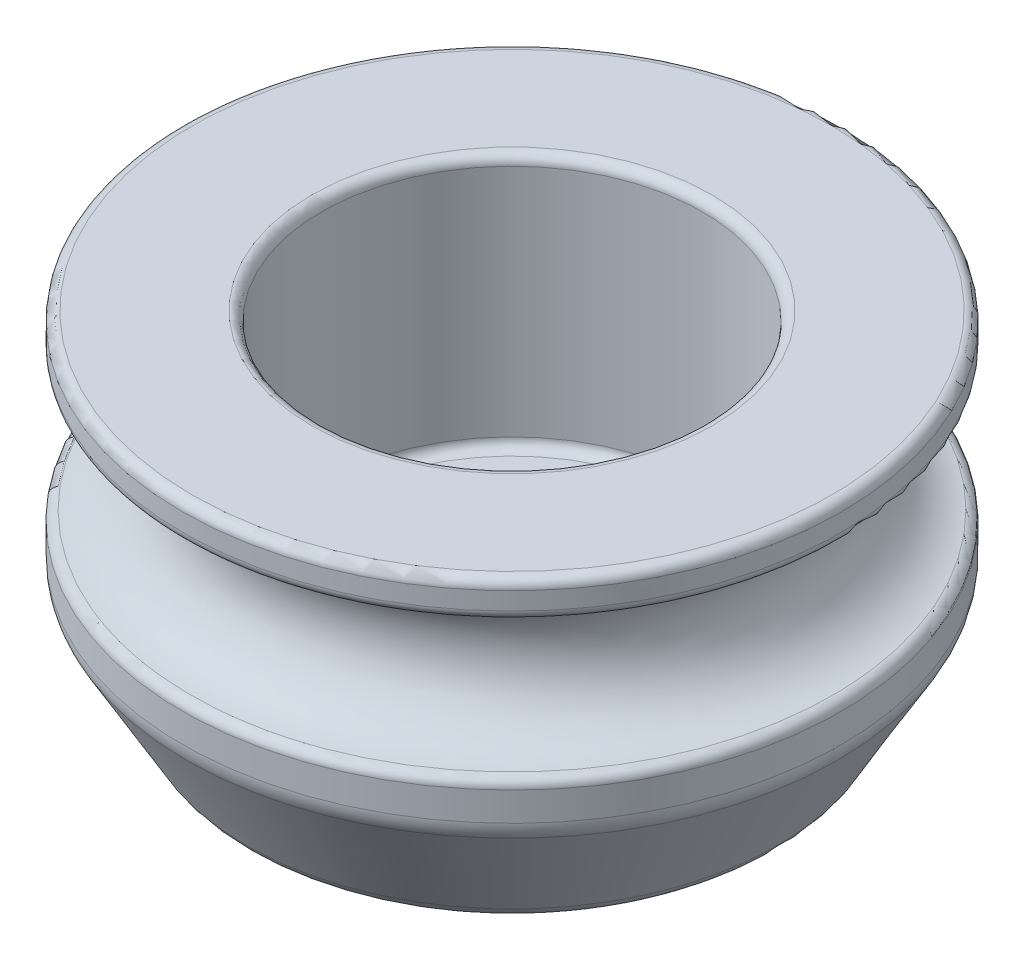
ISO-10303-21;
HEADER;
FILE_DESCRIPTION(('STEP AP214'),'2;1');
FILE_NAME('part.step','',(''),(''),'','','');
FILE_SCHEMA(('AUTOMOTIVE_DESIGN { 1 0 10303 214 1 1 1 1 }'));
ENDSEC;
DATA;
#1=APPLICATION_CONTEXT('core data for automotive mechanical design processes');
#2=APPLICATION_PROTOCOL_DEFINITION('international standard','automotive_design',2000,#1);
#3=PRODUCT_CONTEXT('',#1,'mechanical');
#4=PRODUCT('Part','Part','',(#3));
#5=PRODUCT_RELATED_PRODUCT_CATEGORY('part','',(#4));
#6=PRODUCT_DEFINITION_FORMATION('','',#4);
#7=PRODUCT_DEFINITION_CONTEXT('part definition',#1,'design');
#8=PRODUCT_DEFINITION('design','',#6,#7);
#9=PRODUCT_DEFINITION_SHAPE('','',#8);
#10=(LENGTH_UNIT() NAMED_UNIT(*) SI_UNIT(.MILLI.,.METRE.));
#11=(NAMED_UNIT(*) PLANE_ANGLE_UNIT() SI_UNIT($,.RADIAN.));
#12=(NAMED_UNIT(*) SI_UNIT($,.STERADIAN.) SOLID_ANGLE_UNIT());
#13=UNCERTAINTY_MEASURE_WITH_UNIT(LENGTH_MEASURE(1.E-05),#10,'distance_accuracy_value','');
#14=(GEOMETRIC_REPRESENTATION_CONTEXT(3) GLOBAL_UNCERTAINTY_ASSIGNED_CONTEXT((#13)) GLOBAL_UNIT_ASSIGNED_CONTEXT((#10,
#11,#12)) REPRESENTATION_CONTEXT('',''));
#15=CARTESIAN_POINT('',(0.,0.,0.));
#16=DIRECTION('',(0.,0.,1.));
#17=DIRECTION('',(1.,0.,0.));
#18=AXIS2_PLACEMENT_3D('',#15,#16,#17);
#19=CARTESIAN_POINT('',(0.,9.017,0.));
#20=DIRECTION('',(0.,-1.,0.));
#21=DIRECTION('',(0.,0.,-1.));
#22=AXIS2_PLACEMENT_3D('',#19,#20,#21);
#23=CYLINDRICAL_SURFACE('',#22,8.5725);
#24=CARTESIAN_POINT('',(0.,8.30255699408002,0.));
#25=DIRECTION('',(0.,1.,0.));
#26=DIRECTION('',(0.,0.,1.));
#27=AXIS2_PLACEMENT_3D('',#24,#25,#26);
#28=CIRCLE('',#27,8.5725);
#29=CARTESIAN_POINT('',(0.172203570587984,8.30255699408002,-8.57077022094728));
#30=VERTEX_POINT('',#29);
#31=EDGE_CURVE('E68',#30,#30,#28,.T.);
#32=ORIENTED_EDGE('',*,*,#31,.T.);
#33=EDGE_LOOP('',(#32));
#34=FACE_BOUND('',#33,.T.);
#35=CARTESIAN_POINT('',(0.,8.763,0.));
#36=DIRECTION('',(0.,1.,0.));
#37=DIRECTION('',(0.,0.,1.));
#38=AXIS2_PLACEMENT_3D('',#35,#36,#37);
#39=CIRCLE('',#38,8.5725);
#40=CARTESIAN_POINT('',(0.,8.763,8.5725));
#41=VERTEX_POINT('',#40);
#42=EDGE_CURVE('E107',#41,#41,#39,.F.);
#43=ORIENTED_EDGE('',*,*,#42,.T.);
#44=EDGE_LOOP('',(#43));
#45=FACE_BOUND('',#44,.T.);
#46=ADVANCED_FACE('F38',(#34,#45),#23,.T.);
#47=CARTESIAN_POINT('',(0.,3.52074884677059,0.));
#48=DIRECTION('',(0.,-1.,0.));
#49=DIRECTION('',(0.,0.,-1.));
#50=AXIS2_PLACEMENT_3D('',#47,#48,#49);
#51=CIRCLE('',#50,8.5725);
#52=CARTESIAN_POINT('',(0.,3.52074884677059,-8.5725));
#53=VERTEX_POINT('',#52);
#54=EDGE_CURVE('E79',#53,#53,#51,.F.);
#55=ORIENTED_EDGE('',*,*,#54,.T.);
#56=EDGE_LOOP('',(#55));
#57=FACE_BOUND('',#56,.T.);
#58=CARTESIAN_POINT('',(0.,4.27044300591999,0.));
#59=DIRECTION('',(0.,-1.,0.));
#60=DIRECTION('',(0.,0.,-1.));
#61=AXIS2_PLACEMENT_3D('',#58,#59,#60);
#62=CIRCLE('',#61,8.5725);
#63=CARTESIAN_POINT('',(0.172203570587985,4.27044300591999,-8.57077022094728));
#64=VERTEX_POINT('',#63);
#65=EDGE_CURVE('E101',#64,#64,#62,.T.);
#66=ORIENTED_EDGE('',*,*,#65,.T.);
#67=EDGE_LOOP('',(#66));
#68=FACE_BOUND('',#67,.T.);
#69=ADVANCED_FACE('F95',(#57,#68),#23,.T.);
#70=CARTESIAN_POINT('',(0.,-9.69867661075468,0.));
#71=DIRECTION('',(0.,1.,0.));
#72=DIRECTION('',(0.,0.,1.));
#73=AXIS2_PLACEMENT_3D('',#70,#71,#72);
#74=CYLINDRICAL_SURFACE('',#73,3.429);
#75=CARTESIAN_POINT('',(0.,2.159,0.));
#76=DIRECTION('',(0.,1.,0.));
#77=DIRECTION('',(0.,0.,1.));
#78=AXIS2_PLACEMENT_3D('',#75,#76,#77);
#79=CIRCLE('',#78,3.429);
#80=CARTESIAN_POINT('',(0.,2.159,3.429));
#81=VERTEX_POINT('',#80);
#82=EDGE_CURVE('E122',#81,#81,#79,.T.);
#83=ORIENTED_EDGE('',*,*,#82,.T.);
#84=EDGE_LOOP('',(#83));
#85=FACE_BOUND('',#84,.T.);
#86=CARTESIAN_POINT('',(0.,0.254000000000001,0.));
#87=DIRECTION('',(0.,1.,0.));
#88=DIRECTION('',(0.,0.,1.));
#89=AXIS2_PLACEMENT_3D('',#86,#87,#88);
#90=CIRCLE('',#89,3.429);
#91=CARTESIAN_POINT('',(0.,0.254000000000001,3.429));
#92=VERTEX_POINT('',#91);
#93=EDGE_CURVE('E119',#92,#92,#90,.F.);
#94=ORIENTED_EDGE('',*,*,#93,.T.);
#95=EDGE_LOOP('',(#94));
#96=FACE_BOUND('',#95,.T.);
#97=ADVANCED_FACE('F98',(#85,#96),#74,.F.);
#98=CARTESIAN_POINT('',(0.,9.017,0.));
#99=DIRECTION('',(0.,1.,0.));
#100=DIRECTION('',(0.,0.,1.));
#101=AXIS2_PLACEMENT_3D('',#98,#99,#100);
#102=PLANE('',#101);
#103=CARTESIAN_POINT('',(0.,9.017,0.));
#104=DIRECTION('',(0.,1.,0.));
#105=DIRECTION('',(0.,0.,1.));
#106=AXIS2_PLACEMENT_3D('',#103,#104,#105);
#107=CIRCLE('',#106,5.207);
#108=CARTESIAN_POINT('',(0.,9.017,5.207));
#109=VERTEX_POINT('',#108);
#110=EDGE_CURVE('E76',#109,#109,#107,.F.);
#111=ORIENTED_EDGE('',*,*,#110,.T.);
#112=EDGE_LOOP('',(#111));
#113=FACE_BOUND('',#112,.T.);
#114=CARTESIAN_POINT('',(0.,9.017,0.));
#115=DIRECTION('',(0.,1.,0.));
#116=DIRECTION('',(0.,0.,1.));
#117=AXIS2_PLACEMENT_3D('',#114,#115,#116);
#118=CIRCLE('',#117,8.3185);
#119=CARTESIAN_POINT('',(0.,9.017,8.3185));
#120=VERTEX_POINT('',#119);
#121=EDGE_CURVE('E127',#120,#120,#118,.T.);
#122=ORIENTED_EDGE('',*,*,#121,.T.);
#123=EDGE_LOOP('',(#122));
#124=FACE_BOUND('',#123,.T.);
#125=ADVANCED_FACE('F134',(#113,#124),#102,.T.);
#126=CARTESIAN_POINT('',(0.,0.,0.));
#127=DIRECTION('',(0.,1.,0.));
#128=DIRECTION('',(0.,0.,1.));
#129=AXIS2_PLACEMENT_3D('',#126,#127,#128);
#130=PLANE('',#129);
#131=CARTESIAN_POINT('',(0.,0.,0.));
#132=DIRECTION('',(0.,1.,0.));
#133=DIRECTION('',(0.,0.,1.));
#134=AXIS2_PLACEMENT_3D('',#131,#132,#133);
#135=CIRCLE('',#134,6.19089735278396);
#136=CARTESIAN_POINT('',(0.,0.,6.19089735278396));
#137=VERTEX_POINT('',#136);
#138=EDGE_CURVE('E11',#137,#137,#135,.F.);
#139=ORIENTED_EDGE('',*,*,#138,.T.);
#140=EDGE_LOOP('',(#139));
#141=FACE_BOUND('',#140,.T.);
#142=CARTESIAN_POINT('',(0.,0.,0.));
#143=DIRECTION('',(0.,1.,0.));
#144=DIRECTION('',(0.,0.,1.));
#145=AXIS2_PLACEMENT_3D('',#142,#143,#144);
#146=CIRCLE('',#145,3.683);
#147=CARTESIAN_POINT('',(0.,0.,3.683));
#148=VERTEX_POINT('',#147);
#149=EDGE_CURVE('E125',#148,#148,#146,.T.);
#150=ORIENTED_EDGE('',*,*,#149,.T.);
#151=EDGE_LOOP('',(#150));
#152=FACE_BOUND('',#151,.T.);
#153=ADVANCED_FACE('F156',(#141,#152),#130,.F.);
#154=CARTESIAN_POINT('',(0.,2.413,0.));
#155=DIRECTION('',(0.,1.,0.));
#156=DIRECTION('',(0.,0.,1.));
#157=AXIS2_PLACEMENT_3D('',#154,#155,#156);
#158=PLANE('',#157);
#159=CARTESIAN_POINT('',(0.,2.413,0.));
#160=DIRECTION('',(0.,1.,0.));
#161=DIRECTION('',(0.,0.,1.));
#162=AXIS2_PLACEMENT_3D('',#159,#160,#161);
#163=CIRCLE('',#162,4.699);
#164=CARTESIAN_POINT('',(0.,2.413,4.699));
#165=VERTEX_POINT('',#164);
#166=EDGE_CURVE('E105',#165,#165,#163,.T.);
#167=ORIENTED_EDGE('',*,*,#166,.T.);
#168=EDGE_LOOP('',(#167));
#169=FACE_BOUND('',#168,.T.);
#170=CARTESIAN_POINT('',(0.,2.413,0.));
#171=DIRECTION('',(0.,1.,0.));
#172=DIRECTION('',(0.,0.,1.));
#173=AXIS2_PLACEMENT_3D('',#170,#171,#172);
#174=CIRCLE('',#173,3.683);
#175=CARTESIAN_POINT('',(0.,2.413,3.683));
#176=VERTEX_POINT('',#175);
#177=EDGE_CURVE('E102',#176,#176,#174,.F.);
#178=ORIENTED_EDGE('',*,*,#177,.T.);
#179=EDGE_LOOP('',(#178));
#180=FACE_BOUND('',#179,.T.);
#181=ADVANCED_FACE('F147',(#169,#180),#158,.T.);
#182=CARTESIAN_POINT('',(0.,2.413,0.));
#183=DIRECTION('',(0.,1.,0.));
#184=DIRECTION('',(0.,0.,1.));
#185=AXIS2_PLACEMENT_3D('',#182,#183,#184);
#186=CYLINDRICAL_SURFACE('',#185,4.953);
#187=CARTESIAN_POINT('',(0.,2.667,0.));
#188=DIRECTION('',(0.,1.,0.));
#189=DIRECTION('',(0.,0.,1.));
#190=AXIS2_PLACEMENT_3D('',#187,#188,#189);
#191=CIRCLE('',#190,4.953);
#192=CARTESIAN_POINT('',(0.,2.667,4.953));
#193=VERTEX_POINT('',#192);
#194=EDGE_CURVE('E116',#193,#193,#191,.F.);
#195=CARTESIAN_POINT('',(0.,8.763,0.));
#196=DIRECTION('',(0.,1.,0.));
#197=DIRECTION('',(0.,0.,1.));
#198=AXIS2_PLACEMENT_3D('',#195,#196,#197);
#199=CIRCLE('',#198,4.953);
#200=CARTESIAN_POINT('',(0.,8.763,4.953));
#201=VERTEX_POINT('',#200);
#202=EDGE_CURVE('E113',#201,#201,#199,.T.);
#203=CARTESIAN_POINT('',(0.,2.667,4.953));
#204=CARTESIAN_POINT('',(0.,2.7305,4.953));
#205=CARTESIAN_POINT('',(0.,2.794,4.953));
#206=CARTESIAN_POINT('',(0.,2.921,4.953));
#207=CARTESIAN_POINT('',(0.,2.9845,4.953));
#208=CARTESIAN_POINT('',(0.,3.1115,4.953));
#209=CARTESIAN_POINT('',(0.,3.175,4.953));
#210=CARTESIAN_POINT('',(0.,3.302,4.953));
#211=CARTESIAN_POINT('',(0.,3.3655,4.953));
#212=CARTESIAN_POINT('',(0.,3.4925,4.953));
#213=CARTESIAN_POINT('',(0.,3.556,4.953));
#214=CARTESIAN_POINT('',(0.,3.683,4.953));
#215=CARTESIAN_POINT('',(0.,3.7465,4.953));
#216=CARTESIAN_POINT('',(0.,3.8735,4.953));
#217=CARTESIAN_POINT('',(0.,3.937,4.953));
#218=CARTESIAN_POINT('',(0.,4.064,4.953));
#219=CARTESIAN_POINT('',(0.,4.1275,4.953));
#220=CARTESIAN_POINT('',(0.,4.2545,4.953));
#221=CARTESIAN_POINT('',(0.,4.318,4.953));
#222=CARTESIAN_POINT('',(0.,4.445,4.953));
#223=CARTESIAN_POINT('',(0.,4.5085,4.953));
#224=CARTESIAN_POINT('',(0.,4.6355,4.953));
#225=CARTESIAN_POINT('',(0.,4.699,4.953));
#226=CARTESIAN_POINT('',(0.,4.826,4.953));
#227=CARTESIAN_POINT('',(0.,4.8895,4.953));
#228=CARTESIAN_POINT('',(0.,5.0165,4.953));
#229=CARTESIAN_POINT('',(0.,5.08,4.953));
#230=CARTESIAN_POINT('',(0.,5.207,4.953));
#231=CARTESIAN_POINT('',(0.,5.2705,4.953));
#232=CARTESIAN_POINT('',(0.,5.3975,4.953));
#233=CARTESIAN_POINT('',(0.,5.461,4.953));
#234=CARTESIAN_POINT('',(0.,5.588,4.953));
#235=CARTESIAN_POINT('',(0.,5.6515,4.953));
#236=CARTESIAN_POINT('',(0.,5.7785,4.953));
#237=CARTESIAN_POINT('',(0.,5.842,4.953));
#238=CARTESIAN_POINT('',(0.,5.969,4.953));
#239=CARTESIAN_POINT('',(0.,6.0325,4.953));
#240=CARTESIAN_POINT('',(0.,6.1595,4.953));
#241=CARTESIAN_POINT('',(0.,6.223,4.953));
#242=CARTESIAN_POINT('',(0.,6.35,4.953));
#243=CARTESIAN_POINT('',(0.,6.4135,4.953));
#244=CARTESIAN_POINT('',(0.,6.5405,4.953));
#245=CARTESIAN_POINT('',(0.,6.604,4.953));
#246=CARTESIAN_POINT('',(0.,6.731,4.953));
#247=CARTESIAN_POINT('',(0.,6.7945,4.953));
#248=CARTESIAN_POINT('',(0.,6.9215,4.953));
#249=CARTESIAN_POINT('',(0.,6.985,4.953));
#250=CARTESIAN_POINT('',(0.,7.112,4.953));
#251=CARTESIAN_POINT('',(0.,7.1755,4.953));
#252=CARTESIAN_POINT('',(0.,7.3025,4.953));
#253=CARTESIAN_POINT('',(0.,7.366,4.953));
#254=CARTESIAN_POINT('',(0.,7.493,4.953));
#255=CARTESIAN_POINT('',(0.,7.5565,4.953));
#256=CARTESIAN_POINT('',(0.,7.6835,4.953));
#257=CARTESIAN_POINT('',(0.,7.747,4.953));
#258=CARTESIAN_POINT('',(0.,7.874,4.953));
#259=CARTESIAN_POINT('',(0.,7.9375,4.953));
#260=CARTESIAN_POINT('',(0.,8.0645,4.953));
#261=CARTESIAN_POINT('',(0.,8.128,4.953));
#262=CARTESIAN_POINT('',(0.,8.255,4.953));
#263=CARTESIAN_POINT('',(0.,8.3185,4.953));
#264=CARTESIAN_POINT('',(0.,8.4455,4.953));
#265=CARTESIAN_POINT('',(0.,8.509,4.953));
#266=CARTESIAN_POINT('',(0.,8.636,4.953));
#267=CARTESIAN_POINT('',(0.,8.6995,4.953));
#268=CARTESIAN_POINT('',(0.,8.763,4.953));
#269=B_SPLINE_CURVE_WITH_KNOTS('',3,(#203,#204,#205,#206,#207,#208,#209,#210,#211,#212,#213,
#214,#215,#216,#217,#218,#219,#220,#221,#222,#223,#224,#225,#226,#227,#228,#229,#230,#231,#232,
#233,#234,#235,#236,#237,#238,#239,#240,#241,#242,#243,#244,#245,#246,#247,#248,#249,#250,#251,
#252,#253,#254,#255,#256,#257,#258,#259,#260,#261,#262,#263,#264,#265,#266,#267,#268),
.UNSPECIFIED.,.F.,.F.,(4,2,2,2,2,2,2,2,2,2,2,2,2,2,2,2,2,2,2,2,2,2,2,2,2,2,2,2,2,2,2,2,4),(0.,
0.1905,0.381,0.5715,0.762,0.9525,1.143,1.3335,1.524,1.7145,1.905,2.0955,2.286,2.4765,2.667,
2.8575,3.048,3.2385,3.429,3.6195,3.81,4.0005,4.191,4.3815,4.572,4.7625,4.953,5.1435,5.334,
5.5245,5.715,5.9055,6.096),.UNSPECIFIED.);
#270=EDGE_CURVE('BSEAM144',#193,#201,#269,.T.);
#271=ORIENTED_EDGE('',*,*,#194,.T.);
#272=ORIENTED_EDGE('',*,*,#202,.T.);
#273=ORIENTED_EDGE('',*,*,#270,.T.);
#274=ORIENTED_EDGE('',*,*,#270,.F.);
#275=EDGE_LOOP('',(#271,#273,#272,#274));
#276=FACE_BOUND('',#275,.T.);
#277=ADVANCED_FACE('F144',(#276),#186,.F.);
#278=CARTESIAN_POINT('',(0.167739254163598,6.2865,-10.3488587546764));
#279=CARTESIAN_POINT('',(-20.5299782551891,6.2865,-10.6843372630036));
#280=CARTESIAN_POINT('',(-20.8654567635163,6.2865,10.0133802463492));
#281=CARTESIAN_POINT('',(-0.167739254163598,6.2865,10.3488587546764));
#282=CARTESIAN_POINT('',(20.5299782551891,6.2865,10.6843372630036));
#283=CARTESIAN_POINT('',(20.8654567635163,6.2865,-10.0133802463492));
#284=CARTESIAN_POINT('',(0.167739254163598,6.2865,-10.3488587546764));
#285=CARTESIAN_POINT('',(0.167739254163598,9.8425,-10.3488587546764));
#286=CARTESIAN_POINT('',(-20.5299782551891,9.8425,-10.6843372630036));
#287=CARTESIAN_POINT('',(-20.8654567635163,9.8425,10.0133802463492));
#288=CARTESIAN_POINT('',(-0.167739254163598,9.8425,10.3488587546764));
#289=CARTESIAN_POINT('',(20.5299782551891,9.8425,10.6843372630036));
#290=CARTESIAN_POINT('',(20.8654567635163,9.8425,-10.0133802463492));
#291=CARTESIAN_POINT('',(0.167739254163598,9.8425,-10.3488587546764));
#292=CARTESIAN_POINT('',(0.167739254163598,9.8425,-6.79285875467638));
#293=CARTESIAN_POINT('',(-13.4179782551892,9.8425,-7.12833726300357));
#294=CARTESIAN_POINT('',(-13.7534567635164,9.8425,6.45738024634918));
#295=CARTESIAN_POINT('',(-0.167739254163598,9.8425,6.79285875467638));
#296=CARTESIAN_POINT('',(13.4179782551892,9.8425,7.12833726300357));
#297=CARTESIAN_POINT('',(13.7534567635164,9.8425,-6.45738024634918));
#298=CARTESIAN_POINT('',(0.167739254163598,9.8425,-6.79285875467638));
#299=CARTESIAN_POINT('',(0.167739254163598,6.2865,-6.79285875467638));
#300=CARTESIAN_POINT('',(-13.4179782551892,6.2865,-7.12833726300357));
#301=CARTESIAN_POINT('',(-13.7534567635164,6.2865,6.45738024634918));
#302=CARTESIAN_POINT('',(-0.167739254163598,6.2865,6.79285875467638));
#303=CARTESIAN_POINT('',(13.4179782551892,6.2865,7.12833726300357));
#304=CARTESIAN_POINT('',(13.7534567635164,6.2865,-6.45738024634918));
#305=CARTESIAN_POINT('',(0.167739254163598,6.2865,-6.79285875467638));
#306=CARTESIAN_POINT('',(0.167739254163598,2.73050000000001,-6.79285875467637));
#307=CARTESIAN_POINT('',(-13.4179782551892,2.7305,-7.12833726300357));
#308=CARTESIAN_POINT('',(-13.7534567635163,2.7305,6.45738024634918));
#309=CARTESIAN_POINT('',(-0.167739254163598,2.73050000000001,6.79285875467637));
#310=CARTESIAN_POINT('',(13.4179782551892,2.7305,7.12833726300357));
#311=CARTESIAN_POINT('',(13.7534567635163,2.7305,-6.45738024634918));
#312=CARTESIAN_POINT('',(0.167739254163598,2.73050000000001,-6.79285875467637));
#313=CARTESIAN_POINT('',(0.167739254163598,2.73050000000001,-10.3488587546764));
#314=CARTESIAN_POINT('',(-20.5299782551891,2.7305,-10.6843372630036));
#315=CARTESIAN_POINT('',(-20.8654567635163,2.7305,10.0133802463492));
#316=CARTESIAN_POINT('',(-0.167739254163598,2.73050000000001,10.3488587546764));
#317=CARTESIAN_POINT('',(20.5299782551891,2.7305,10.6843372630036));
#318=CARTESIAN_POINT('',(20.8654567635163,2.7305,-10.0133802463492));
#319=CARTESIAN_POINT('',(0.167739254163598,2.73050000000001,-10.3488587546764));
#320=CARTESIAN_POINT('',(0.167739254163598,6.2865,-10.3488587546764));
#321=CARTESIAN_POINT('',(-20.5299782551891,6.2865,-10.6843372630036));
#322=CARTESIAN_POINT('',(-20.8654567635163,6.2865,10.0133802463492));
#323=CARTESIAN_POINT('',(-0.167739254163598,6.2865,10.3488587546764));
#324=CARTESIAN_POINT('',(20.5299782551891,6.2865,10.6843372630036));
#325=CARTESIAN_POINT('',(20.8654567635163,6.2865,-10.0133802463492));
#326=CARTESIAN_POINT('',(0.167739254163598,6.2865,-10.3488587546764));
#327=(BOUNDED_SURFACE() B_SPLINE_SURFACE(3,3,((#278,#279,#280,#281,#282,#283,#284),(#285,#286,
#287,#288,#289,#290,#291),(#292,#293,#294,#295,#296,#297,#298),(#299,#300,#301,#302,#303,#304,
#305),(#306,#307,#308,#309,#310,#311,#312),(#313,#314,#315,#316,#317,#318,#319),(#320,#321,#322,
#323,#324,#325,#326)),.UNSPECIFIED.,.T.,.T.,.F.) B_SPLINE_SURFACE_WITH_KNOTS((4,3,4),(4,3,4),
(0.,0.5,1.),(0.,0.5,1.),
.UNSPECIFIED.) GEOMETRIC_REPRESENTATION_ITEM() RATIONAL_B_SPLINE_SURFACE(((1.,0.333333333333333,
0.333333333333333,1.,0.333333333333333,0.333333333333333,1.),(0.333333333333333,
0.111111111111111,0.111111111111111,0.333333333333333,0.111111111111111,0.111111111111111,
0.333333333333333),(0.333333333333333,0.111111111111111,0.111111111111111,0.333333333333333,
0.111111111111111,0.111111111111111,0.333333333333333),(1.,0.333333333333333,0.333333333333333,
1.,0.333333333333333,0.333333333333333,1.),(0.333333333333333,0.111111111111111,
0.111111111111111,0.333333333333333,0.111111111111111,0.111111111111111,0.333333333333333),
(0.333333333333333,0.111111111111111,0.111111111111111,0.333333333333333,0.111111111111111,
0.111111111111111,0.333333333333333),(1.,0.333333333333333,0.333333333333333,1.,
0.333333333333333,0.333333333333333,1.))) REPRESENTATION_ITEM('') SURFACE());
#328=CARTESIAN_POINT('',(0.167739254163598,6.2865,-8.57085875467637));
#329=DIRECTION('',(1.,0.,0.));
#330=DIRECTION('',(0.,0.,-1.));
#331=AXIS2_PLACEMENT_3D('',#328,#329,#330);
#332=CIRCLE('',#331,1.778);
#333=CARTESIAN_POINT('',(0.167739254163598,8.05055056545504,-8.34857604613213));
#334=VERTEX_POINT('',#333);
#335=CARTESIAN_POINT('',(0.167739254163598,4.52244943454497,-8.34857604613212));
#336=VERTEX_POINT('',#335);
#337=EDGE_CURVE('E69',#334,#336,#332,.T.);
#338=CARTESIAN_POINT('',(0.,8.05055056545504,0.));
#339=DIRECTION('',(0.,1.,0.));
#340=DIRECTION('',(0.,0.,1.));
#341=AXIS2_PLACEMENT_3D('',#338,#339,#340);
#342=CIRCLE('',#341,8.35026098127709);
#343=EDGE_CURVE('E66',#334,#334,#342,.F.);
#344=CARTESIAN_POINT('',(0.,4.52244943454497,0.));
#345=DIRECTION('',(0.,1.,0.));
#346=DIRECTION('',(0.,0.,1.));
#347=AXIS2_PLACEMENT_3D('',#344,#345,#346);
#348=CIRCLE('',#347,8.35026098127708);
#349=EDGE_CURVE('E72',#336,#336,#348,.T.);
#350=ORIENTED_EDGE('',*,*,#337,.F.);
#351=ORIENTED_EDGE('',*,*,#343,.T.);
#352=ORIENTED_EDGE('',*,*,#337,.T.);
#353=ORIENTED_EDGE('',*,*,#349,.T.);
#354=EDGE_LOOP('',(#350,#351,#352,#353));
#355=FACE_BOUND('',#354,.T.);
#356=ADVANCED_FACE('F146',(#355),#327,.T.);
#357=CARTESIAN_POINT('',(0.,8.30255699408002,0.));
#358=DIRECTION('',(0.,1.,0.));
#359=DIRECTION('',(0.,0.,1.));
#360=AXIS2_PLACEMENT_3D('',#357,#358,#359);
#361=TOROIDAL_SURFACE('',#360,8.3185,0.254);
#362=CARTESIAN_POINT('',(0.167101242570563,8.30255699408002,-8.31682147365996));
#363=DIRECTION('',(-0.999798217666641,0.,-0.0200879055804007));
#364=DIRECTION('',(-0.0200879055804007,0.,0.999798217666641));
#365=AXIS2_PLACEMENT_3D('',#362,#363,#364);
#366=CIRCLE('',#365,0.254);
#367=EDGE_CURVE('E60',#30,#334,#366,.T.);
#368=ORIENTED_EDGE('',*,*,#367,.F.);
#369=ORIENTED_EDGE('',*,*,#31,.F.);
#370=ORIENTED_EDGE('',*,*,#367,.T.);
#371=ORIENTED_EDGE('',*,*,#343,.F.);
#372=EDGE_LOOP('',(#368,#369,#370,#371));
#373=FACE_BOUND('',#372,.T.);
#374=ADVANCED_FACE('F64',(#373),#361,.T.);
#375=CARTESIAN_POINT('',(0.,4.27044300591999,0.));
#376=DIRECTION('',(0.,-1.,0.));
#377=DIRECTION('',(0.,0.,-1.));
#378=AXIS2_PLACEMENT_3D('',#375,#376,#377);
#379=TOROIDAL_SURFACE('',#378,8.3185,0.254);
#380=CARTESIAN_POINT('',(0.167101242570563,4.27044300591999,-8.31682147365996));
#381=DIRECTION('',(0.999798217666641,0.,0.0200879055804007));
#382=DIRECTION('',(0.0200879055804007,0.,-0.999798217666641));
#383=AXIS2_PLACEMENT_3D('',#380,#381,#382);
#384=CIRCLE('',#383,0.254);
#385=EDGE_CURVE('E53',#64,#336,#384,.T.);
#386=ORIENTED_EDGE('',*,*,#385,.F.);
#387=ORIENTED_EDGE('',*,*,#65,.F.);
#388=ORIENTED_EDGE('',*,*,#385,.T.);
#389=ORIENTED_EDGE('',*,*,#349,.F.);
#390=EDGE_LOOP('',(#386,#387,#388,#389));
#391=FACE_BOUND('',#390,.T.);
#392=ADVANCED_FACE('F170',(#391),#379,.T.);
#393=CARTESIAN_POINT('',(0.,2.667,0.));
#394=DIRECTION('',(0.,1.,0.));
#395=DIRECTION('',(0.,0.,1.));
#396=AXIS2_PLACEMENT_3D('',#393,#394,#395);
#397=TOROIDAL_SURFACE('',#396,4.699,0.254);
#398=ORIENTED_EDGE('',*,*,#194,.F.);
#399=EDGE_LOOP('',(#398));
#400=FACE_BOUND('',#399,.T.);
#401=ORIENTED_EDGE('',*,*,#166,.F.);
#402=EDGE_LOOP('',(#401));
#403=FACE_BOUND('',#402,.T.);
#404=ADVANCED_FACE('F173',(#400,#403),#397,.F.);
#405=CARTESIAN_POINT('',(0.,2.159,0.));
#406=DIRECTION('',(0.,1.,0.));
#407=DIRECTION('',(0.,0.,1.));
#408=AXIS2_PLACEMENT_3D('',#405,#406,#407);
#409=TOROIDAL_SURFACE('',#408,3.683,0.254);
#410=ORIENTED_EDGE('',*,*,#82,.F.);
#411=EDGE_LOOP('',(#410));
#412=FACE_BOUND('',#411,.T.);
#413=ORIENTED_EDGE('',*,*,#177,.F.);
#414=EDGE_LOOP('',(#413));
#415=FACE_BOUND('',#414,.T.);
#416=ADVANCED_FACE('F176',(#412,#415),#409,.T.);
#417=CARTESIAN_POINT('',(0.,0.254000000000001,0.));
#418=DIRECTION('',(0.,1.,0.));
#419=DIRECTION('',(0.,0.,1.));
#420=AXIS2_PLACEMENT_3D('',#417,#418,#419);
#421=TOROIDAL_SURFACE('',#420,3.683,0.254);
#422=ORIENTED_EDGE('',*,*,#149,.F.);
#423=EDGE_LOOP('',(#422));
#424=FACE_BOUND('',#423,.T.);
#425=ORIENTED_EDGE('',*,*,#93,.F.);
#426=EDGE_LOOP('',(#425));
#427=FACE_BOUND('',#426,.T.);
#428=ADVANCED_FACE('F140',(#424,#427),#421,.T.);
#429=CARTESIAN_POINT('',(0.,8.763,0.));
#430=DIRECTION('',(0.,1.,0.));
#431=DIRECTION('',(0.,0.,1.));
#432=AXIS2_PLACEMENT_3D('',#429,#430,#431);
#433=TOROIDAL_SURFACE('',#432,5.207,0.254);
#434=ORIENTED_EDGE('',*,*,#110,.F.);
#435=EDGE_LOOP('',(#434));
#436=FACE_BOUND('',#435,.T.);
#437=ORIENTED_EDGE('',*,*,#202,.F.);
#438=EDGE_LOOP('',(#437));
#439=FACE_BOUND('',#438,.T.);
#440=ADVANCED_FACE('F136',(#436,#439),#433,.T.);
#441=CARTESIAN_POINT('',(0.,8.763,0.));
#442=DIRECTION('',(0.,1.,0.));
#443=DIRECTION('',(0.,0.,1.));
#444=AXIS2_PLACEMENT_3D('',#441,#442,#443);
#445=TOROIDAL_SURFACE('',#444,8.3185,0.254);
#446=ORIENTED_EDGE('',*,*,#42,.F.);
#447=EDGE_LOOP('',(#446));
#448=FACE_BOUND('',#447,.T.);
#449=ORIENTED_EDGE('',*,*,#121,.F.);
#450=EDGE_LOOP('',(#449));
#451=FACE_BOUND('',#450,.T.);
#452=ADVANCED_FACE('F139',(#448,#451),#445,.T.);
#453=CARTESIAN_POINT('',(0.,3.2995567884187,0.));
#454=DIRECTION('',(0.,1.,0.));
#455=DIRECTION('',(0.,0.,1.));
#456=AXIS2_PLACEMENT_3D('',#453,#454,#455);
#457=CONICAL_SURFACE('',#456,8.5725,0.5235987755983);
#458=CARTESIAN_POINT('',(0.,3.10799884677059,0.));
#459=DIRECTION('',(0.,1.,0.));
#460=DIRECTION('',(0.,0.,1.));
#461=AXIS2_PLACEMENT_3D('',#458,#459,#460);
#462=CIRCLE('',#461,8.46190397082406);
#463=CARTESIAN_POINT('',(0.,3.10799884677059,8.46190397082406));
#464=VERTEX_POINT('',#463);
#465=EDGE_CURVE('E46',#464,#464,#462,.F.);
#466=ORIENTED_EDGE('',*,*,#465,.T.);
#467=EDGE_LOOP('',(#466));
#468=FACE_BOUND('',#467,.T.);
#469=CARTESIAN_POINT('',(0.,0.412749999999999,0.));
#470=DIRECTION('',(0.,1.,0.));
#471=DIRECTION('',(0.,0.,1.));
#472=AXIS2_PLACEMENT_3D('',#469,#470,#471);
#473=CIRCLE('',#472,6.90580132360802);
#474=CARTESIAN_POINT('',(0.,0.412749999999999,6.90580132360802));
#475=VERTEX_POINT('',#474);
#476=EDGE_CURVE('E82',#475,#475,#473,.T.);
#477=ORIENTED_EDGE('',*,*,#476,.T.);
#478=EDGE_LOOP('',(#477));
#479=FACE_BOUND('',#478,.T.);
#480=ADVANCED_FACE('F87',(#468,#479),#457,.T.);
#481=CARTESIAN_POINT('',(0.,3.52074884677059,0.));
#482=DIRECTION('',(0.,-1.,0.));
#483=DIRECTION('',(0.,0.,-1.));
#484=AXIS2_PLACEMENT_3D('',#481,#482,#483);
#485=TOROIDAL_SURFACE('',#484,7.747,0.8255);
#486=ORIENTED_EDGE('',*,*,#465,.F.);
#487=EDGE_LOOP('',(#486));
#488=FACE_BOUND('',#487,.T.);
#489=ORIENTED_EDGE('',*,*,#54,.F.);
#490=EDGE_LOOP('',(#489));
#491=FACE_BOUND('',#490,.T.);
#492=ADVANCED_FACE('F90',(#488,#491),#485,.T.);
#493=CARTESIAN_POINT('',(0.,0.8255,0.));
#494=DIRECTION('',(0.,1.,0.));
#495=DIRECTION('',(0.,0.,1.));
#496=AXIS2_PLACEMENT_3D('',#493,#494,#495);
#497=TOROIDAL_SURFACE('',#496,6.19089735278396,0.8255);
#498=ORIENTED_EDGE('',*,*,#476,.F.);
#499=EDGE_LOOP('',(#498));
#500=FACE_BOUND('',#499,.T.);
#501=ORIENTED_EDGE('',*,*,#138,.F.);
#502=EDGE_LOOP('',(#501));
#503=FACE_BOUND('',#502,.T.);
#504=ADVANCED_FACE('F40',(#500,#503),#497,.T.);
#505=CLOSED_SHELL('',(#46,#69,#97,#125,#153,#181,#277,#356,#374,#392,#404,#416,#428,#440,#452,
#480,#492,#504));
#506=MANIFOLD_SOLID_BREP('B2',#505);
#507=ADVANCED_BREP_SHAPE_REPRESENTATION('',(#18,#506),#14);
#508=SHAPE_DEFINITION_REPRESENTATION(#9,#507);
ENDSEC;
END-ISO-10303-21;
